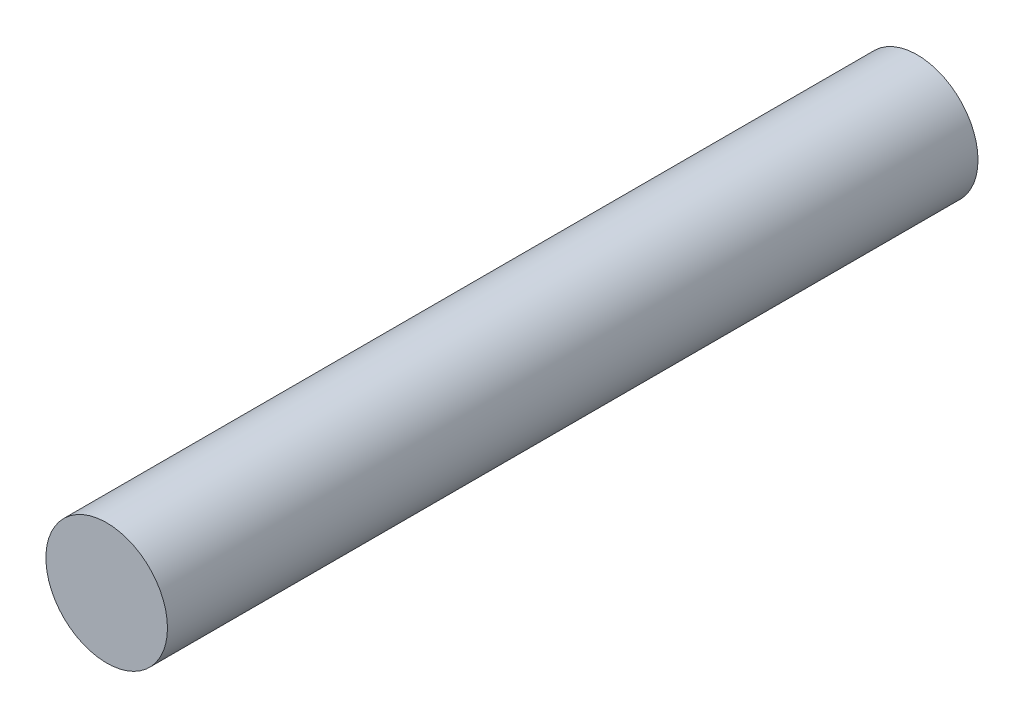
ISO-10303-21;
HEADER;
FILE_DESCRIPTION(('STEP AP214'),'2;1');
FILE_NAME('part.step','',(''),(''),'','','');
FILE_SCHEMA(('AUTOMOTIVE_DESIGN { 1 0 10303 214 1 1 1 1 }'));
ENDSEC;
DATA;
#1=APPLICATION_CONTEXT('core data for automotive mechanical design processes');
#2=APPLICATION_PROTOCOL_DEFINITION('international standard','automotive_design',2000,#1);
#3=PRODUCT_CONTEXT('',#1,'mechanical');
#4=PRODUCT('Part','Part','',(#3));
#5=PRODUCT_RELATED_PRODUCT_CATEGORY('part','',(#4));
#6=PRODUCT_DEFINITION_FORMATION('','',#4);
#7=PRODUCT_DEFINITION_CONTEXT('part definition',#1,'design');
#8=PRODUCT_DEFINITION('design','',#6,#7);
#9=PRODUCT_DEFINITION_SHAPE('','',#8);
#10=(LENGTH_UNIT() NAMED_UNIT(*) SI_UNIT(.MILLI.,.METRE.));
#11=(NAMED_UNIT(*) PLANE_ANGLE_UNIT() SI_UNIT($,.RADIAN.));
#12=(NAMED_UNIT(*) SI_UNIT($,.STERADIAN.) SOLID_ANGLE_UNIT());
#13=UNCERTAINTY_MEASURE_WITH_UNIT(LENGTH_MEASURE(1.E-05),#10,'distance_accuracy_value','');
#14=(GEOMETRIC_REPRESENTATION_CONTEXT(3) GLOBAL_UNCERTAINTY_ASSIGNED_CONTEXT((#13)) GLOBAL_UNIT_ASSIGNED_CONTEXT((#10,
#11,#12)) REPRESENTATION_CONTEXT('',''));
#15=CARTESIAN_POINT('',(0.,0.,0.));
#16=DIRECTION('',(0.,0.,1.));
#17=DIRECTION('',(1.,0.,0.));
#18=AXIS2_PLACEMENT_3D('',#15,#16,#17);
#19=CARTESIAN_POINT('',(0.,0.,20.));
#20=DIRECTION('',(0.,0.,-1.));
#21=DIRECTION('',(-1.,0.,0.));
#22=AXIS2_PLACEMENT_3D('',#19,#20,#21);
#23=CYLINDRICAL_SURFACE('',#22,1.5);
#24=CARTESIAN_POINT('',(0.,0.,20.));
#25=DIRECTION('',(0.,0.,1.));
#26=DIRECTION('',(1.,0.,0.));
#27=AXIS2_PLACEMENT_3D('',#24,#25,#26);
#28=CIRCLE('',#27,1.5);
#29=CARTESIAN_POINT('',(1.5,0.,20.));
#30=VERTEX_POINT('',#29);
#31=EDGE_CURVE('E10',#30,#30,#28,.T.);
#32=ORIENTED_EDGE('',*,*,#31,.F.);
#33=EDGE_LOOP('',(#32));
#34=FACE_BOUND('',#33,.T.);
#35=CARTESIAN_POINT('',(0.,0.,0.));
#36=DIRECTION('',(0.,0.,1.));
#37=DIRECTION('',(1.,0.,0.));
#38=AXIS2_PLACEMENT_3D('',#35,#36,#37);
#39=CIRCLE('',#38,1.5);
#40=CARTESIAN_POINT('',(1.5,0.,0.));
#41=VERTEX_POINT('',#40);
#42=EDGE_CURVE('E40',#41,#41,#39,.T.);
#43=ORIENTED_EDGE('',*,*,#42,.T.);
#44=EDGE_LOOP('',(#43));
#45=FACE_BOUND('',#44,.T.);
#46=ADVANCED_FACE('F37',(#34,#45),#23,.T.);
#47=CARTESIAN_POINT('',(0.,0.,20.));
#48=DIRECTION('',(0.,0.,1.));
#49=DIRECTION('',(1.,0.,0.));
#50=AXIS2_PLACEMENT_3D('',#47,#48,#49);
#51=PLANE('',#50);
#52=ORIENTED_EDGE('',*,*,#31,.T.);
#53=EDGE_LOOP('',(#52));
#54=FACE_BOUND('',#53,.T.);
#55=ADVANCED_FACE('F54',(#54),#51,.T.);
#56=CARTESIAN_POINT('',(0.,0.,0.));
#57=DIRECTION('',(0.,0.,1.));
#58=DIRECTION('',(1.,0.,0.));
#59=AXIS2_PLACEMENT_3D('',#56,#57,#58);
#60=PLANE('',#59);
#61=ORIENTED_EDGE('',*,*,#42,.F.);
#62=EDGE_LOOP('',(#61));
#63=FACE_BOUND('',#62,.T.);
#64=ADVANCED_FACE('F52',(#63),#60,.F.);
#65=CLOSED_SHELL('',(#46,#55,#64));
#66=MANIFOLD_SOLID_BREP('B2',#65);
#67=ADVANCED_BREP_SHAPE_REPRESENTATION('',(#18,#66),#14);
#68=SHAPE_DEFINITION_REPRESENTATION(#9,#67);
ENDSEC;
END-ISO-10303-21;
